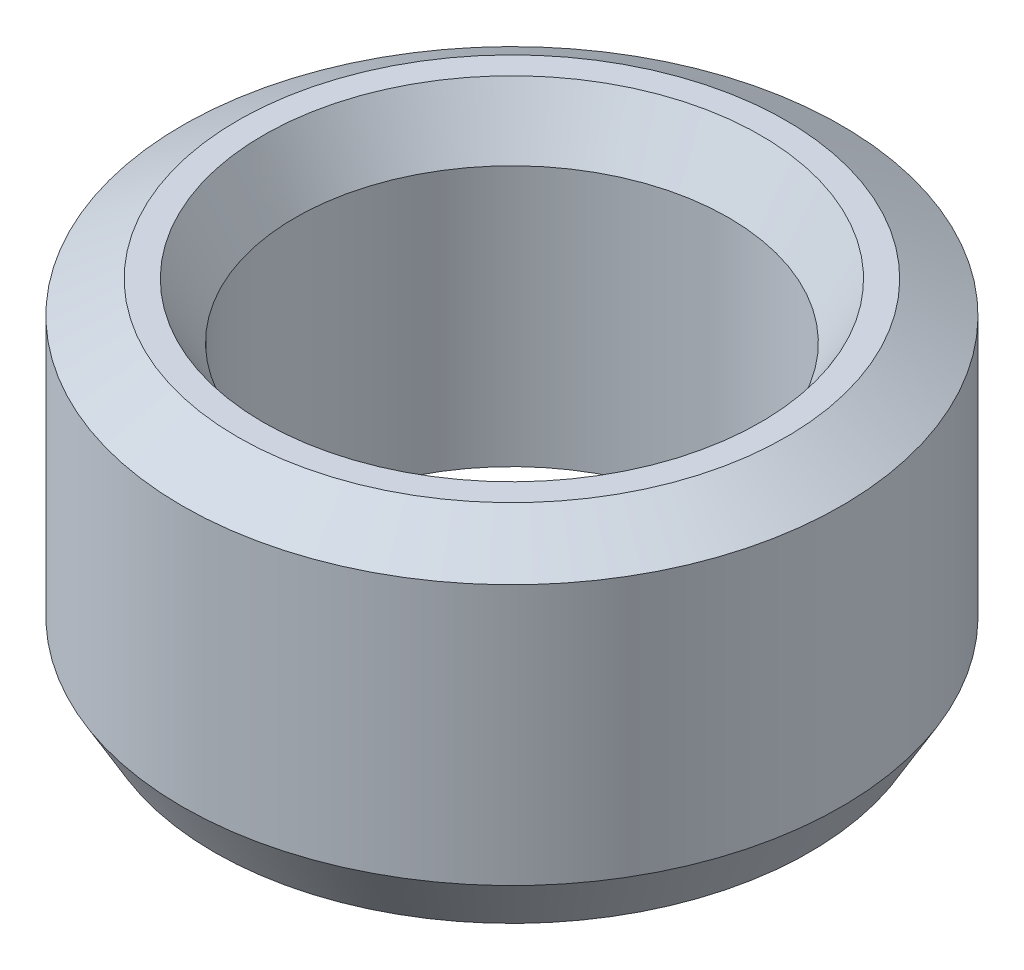
ISO-10303-21;
HEADER;
FILE_DESCRIPTION(('STEP AP214'),'2;1');
FILE_NAME('part.step','',(''),(''),'','','');
FILE_SCHEMA(('AUTOMOTIVE_DESIGN { 1 0 10303 214 1 1 1 1 }'));
ENDSEC;
DATA;
#1=APPLICATION_CONTEXT('core data for automotive mechanical design processes');
#2=APPLICATION_PROTOCOL_DEFINITION('international standard','automotive_design',2000,#1);
#3=PRODUCT_CONTEXT('',#1,'mechanical');
#4=PRODUCT('Part','Part','',(#3));
#5=PRODUCT_RELATED_PRODUCT_CATEGORY('part','',(#4));
#6=PRODUCT_DEFINITION_FORMATION('','',#4);
#7=PRODUCT_DEFINITION_CONTEXT('part definition',#1,'design');
#8=PRODUCT_DEFINITION('design','',#6,#7);
#9=PRODUCT_DEFINITION_SHAPE('','',#8);
#10=(LENGTH_UNIT() NAMED_UNIT(*) SI_UNIT(.MILLI.,.METRE.));
#11=(NAMED_UNIT(*) PLANE_ANGLE_UNIT() SI_UNIT($,.RADIAN.));
#12=(NAMED_UNIT(*) SI_UNIT($,.STERADIAN.) SOLID_ANGLE_UNIT());
#13=UNCERTAINTY_MEASURE_WITH_UNIT(LENGTH_MEASURE(1.E-05),#10,'distance_accuracy_value','');
#14=(GEOMETRIC_REPRESENTATION_CONTEXT(3) GLOBAL_UNCERTAINTY_ASSIGNED_CONTEXT((#13)) GLOBAL_UNIT_ASSIGNED_CONTEXT((#10,
#11,#12)) REPRESENTATION_CONTEXT('',''));
#15=CARTESIAN_POINT('',(0.,0.,0.));
#16=DIRECTION('',(0.,0.,1.));
#17=DIRECTION('',(1.,0.,0.));
#18=AXIS2_PLACEMENT_3D('',#15,#16,#17);
#19=CARTESIAN_POINT('',(0.,36.9426235670901,0.));
#20=DIRECTION('',(0.,-1.,0.));
#21=DIRECTION('',(0.,0.,-1.));
#22=AXIS2_PLACEMENT_3D('',#19,#20,#21);
#23=CYLINDRICAL_SURFACE('',#22,35.);
#24=CARTESIAN_POINT('',(0.,5.87959630314203,0.));
#25=DIRECTION('',(0.,1.,0.));
#26=DIRECTION('',(0.,0.,1.));
#27=AXIS2_PLACEMENT_3D('',#24,#25,#26);
#28=CIRCLE('',#27,35.);
#29=CARTESIAN_POINT('',(0.,5.87959630314203,35.));
#30=VERTEX_POINT('',#29);
#31=EDGE_CURVE('E10',#30,#30,#28,.T.);
#32=ORIENTED_EDGE('',*,*,#31,.T.);
#33=EDGE_LOOP('',(#32));
#34=FACE_BOUND('',#33,.T.);
#35=CARTESIAN_POINT('',(0.,33.5480370587447,0.));
#36=DIRECTION('',(0.,1.,0.));
#37=DIRECTION('',(0.,0.,1.));
#38=AXIS2_PLACEMENT_3D('',#35,#36,#37);
#39=CIRCLE('',#38,35.);
#40=CARTESIAN_POINT('',(0.,33.5480370587447,35.));
#41=VERTEX_POINT('',#40);
#42=EDGE_CURVE('E50',#41,#41,#39,.F.);
#43=ORIENTED_EDGE('',*,*,#42,.T.);
#44=EDGE_LOOP('',(#43));
#45=FACE_BOUND('',#44,.T.);
#46=ADVANCED_FACE('F39',(#34,#45),#23,.T.);
#47=CARTESIAN_POINT('',(0.,36.9426235670901,0.));
#48=DIRECTION('',(0.,1.,0.));
#49=DIRECTION('',(0.,0.,1.));
#50=AXIS2_PLACEMENT_3D('',#47,#48,#49);
#51=PLANE('',#50);
#52=CARTESIAN_POINT('',(0.,36.9426235670901,0.));
#53=DIRECTION('',(0.,1.,0.));
#54=DIRECTION('',(0.,0.,1.));
#55=AXIS2_PLACEMENT_3D('',#52,#53,#54);
#56=CIRCLE('',#55,26.4068512775485);
#57=CARTESIAN_POINT('',(0.,36.9426235670901,26.4068512775485));
#58=VERTEX_POINT('',#57);
#59=EDGE_CURVE('E58',#58,#58,#56,.F.);
#60=ORIENTED_EDGE('',*,*,#59,.T.);
#61=EDGE_LOOP('',(#60));
#62=FACE_BOUND('',#61,.T.);
#63=CARTESIAN_POINT('',(0.,36.9426235670901,0.));
#64=DIRECTION('',(0.,1.,0.));
#65=DIRECTION('',(0.,0.,1.));
#66=AXIS2_PLACEMENT_3D('',#63,#64,#65);
#67=CIRCLE('',#66,29.1204036968579);
#68=CARTESIAN_POINT('',(0.,36.9426235670901,29.1204036968579));
#69=VERTEX_POINT('',#68);
#70=EDGE_CURVE('E61',#69,#69,#67,.T.);
#71=ORIENTED_EDGE('',*,*,#70,.T.);
#72=EDGE_LOOP('',(#71));
#73=FACE_BOUND('',#72,.T.);
#74=ADVANCED_FACE('F88',(#62,#73),#51,.T.);
#75=CARTESIAN_POINT('',(0.,0.,0.));
#76=DIRECTION('',(0.,1.,0.));
#77=DIRECTION('',(0.,0.,1.));
#78=AXIS2_PLACEMENT_3D('',#75,#76,#77);
#79=PLANE('',#78);
#80=CARTESIAN_POINT('',(0.,0.,0.));
#81=DIRECTION('',(0.,1.,0.));
#82=DIRECTION('',(0.,0.,1.));
#83=AXIS2_PLACEMENT_3D('',#80,#81,#82);
#84=CIRCLE('',#83,28.8918610723451);
#85=CARTESIAN_POINT('',(0.,0.,28.8918610723451));
#86=VERTEX_POINT('',#85);
#87=EDGE_CURVE('E51',#86,#86,#84,.T.);
#88=ORIENTED_EDGE('',*,*,#87,.T.);
#89=EDGE_LOOP('',(#88));
#90=FACE_BOUND('',#89,.T.);
#91=CARTESIAN_POINT('',(0.,0.,0.));
#92=DIRECTION('',(0.,1.,0.));
#93=DIRECTION('',(0.,0.,1.));
#94=AXIS2_PLACEMENT_3D('',#91,#92,#93);
#95=CIRCLE('',#94,31.6054134916546);
#96=CARTESIAN_POINT('',(0.,0.,31.6054134916546));
#97=VERTEX_POINT('',#96);
#98=EDGE_CURVE('E54',#97,#97,#95,.F.);
#99=ORIENTED_EDGE('',*,*,#98,.T.);
#100=EDGE_LOOP('',(#99));
#101=FACE_BOUND('',#100,.T.);
#102=ADVANCED_FACE('F83',(#90,#101),#79,.F.);
#103=CARTESIAN_POINT('',(0.,36.9426235670901,0.));
#104=DIRECTION('',(0.,-1.,0.));
#105=DIRECTION('',(0.,0.,-1.));
#106=AXIS2_PLACEMENT_3D('',#103,#104,#105);
#107=CYLINDRICAL_SURFACE('',#106,23.012264769203);
#108=CARTESIAN_POINT('',(0.,31.0630272639481,0.));
#109=DIRECTION('',(0.,1.,0.));
#110=DIRECTION('',(0.,0.,1.));
#111=AXIS2_PLACEMENT_3D('',#108,#109,#110);
#112=CIRCLE('',#111,23.012264769203);
#113=CARTESIAN_POINT('',(0.,31.0630272639481,23.012264769203));
#114=VERTEX_POINT('',#113);
#115=EDGE_CURVE('E67',#114,#114,#112,.T.);
#116=ORIENTED_EDGE('',*,*,#115,.T.);
#117=EDGE_LOOP('',(#116));
#118=FACE_BOUND('',#117,.T.);
#119=CARTESIAN_POINT('',(0.,3.39458650834541,0.));
#120=DIRECTION('',(0.,1.,0.));
#121=DIRECTION('',(0.,0.,1.));
#122=AXIS2_PLACEMENT_3D('',#119,#120,#121);
#123=CIRCLE('',#122,23.012264769203);
#124=CARTESIAN_POINT('',(0.,3.39458650834541,23.012264769203));
#125=VERTEX_POINT('',#124);
#126=EDGE_CURVE('E69',#125,#125,#123,.F.);
#127=ORIENTED_EDGE('',*,*,#126,.T.);
#128=EDGE_LOOP('',(#127));
#129=FACE_BOUND('',#128,.T.);
#130=ADVANCED_FACE('F71',(#118,#129),#107,.F.);
#131=CARTESIAN_POINT('',(0.,31.0630272639481,0.));
#132=DIRECTION('',(0.,1.,0.));
#133=DIRECTION('',(0.,0.,1.));
#134=AXIS2_PLACEMENT_3D('',#131,#132,#133);
#135=CONICAL_SURFACE('',#134,23.012264769203,0.523598775598304);
#136=CARTESIAN_POINT('',(0.,36.9426235670901,26.4068512775485));
#137=CARTESIAN_POINT('',(0.,36.8813777722657,26.3714910014199));
#138=CARTESIAN_POINT('',(0.,36.8201319774413,26.3361307252913));
#139=CARTESIAN_POINT('',(0.,36.6976403877925,26.2654101730341));
#140=CARTESIAN_POINT('',(0.,36.6363945929681,26.2300498969055));
#141=CARTESIAN_POINT('',(0.,36.5139030033193,26.1593293446483));
#142=CARTESIAN_POINT('',(0.,36.4526572084949,26.1239690685197));
#143=CARTESIAN_POINT('',(0.,36.3301656188461,26.0532485162625));
#144=CARTESIAN_POINT('',(0.,36.2689198240218,26.0178882401339));
#145=CARTESIAN_POINT('',(0.,36.146428234373,25.9471676878767));
#146=CARTESIAN_POINT('',(0.,36.0851824395486,25.9118074117481));
#147=CARTESIAN_POINT('',(0.,35.9626908498998,25.8410868594909));
#148=CARTESIAN_POINT('',(0.,35.9014450550754,25.8057265833623));
#149=CARTESIAN_POINT('',(0.,35.7789534654266,25.7350060311051));
#150=CARTESIAN_POINT('',(0.,35.7177076706022,25.6996457549765));
#151=CARTESIAN_POINT('',(0.,35.5952160809534,25.6289252027193));
#152=CARTESIAN_POINT('',(0.,35.533970286129,25.5935649265907));
#153=CARTESIAN_POINT('',(0.,35.4114786964802,25.5228443743335));
#154=CARTESIAN_POINT('',(0.,35.3502329016558,25.4874840982049));
#155=CARTESIAN_POINT('',(0.,35.227741312007,25.4167635459477));
#156=CARTESIAN_POINT('',(0.,35.1664955171826,25.3814032698191));
#157=CARTESIAN_POINT('',(0.,35.0440039275338,25.3106827175619));
#158=CARTESIAN_POINT('',(0.,34.9827581327094,25.2753224414333));
#159=CARTESIAN_POINT('',(0.,34.8602665430606,25.2046018891761));
#160=CARTESIAN_POINT('',(0.,34.7990207482362,25.1692416130475));
#161=CARTESIAN_POINT('',(0.,34.6765291585874,25.0985210607903));
#162=CARTESIAN_POINT('',(0.,34.615283363763,25.0631607846617));
#163=CARTESIAN_POINT('',(0.,34.4927917741143,24.9924402324045));
#164=CARTESIAN_POINT('',(0.,34.4315459792899,24.9570799562759));
#165=CARTESIAN_POINT('',(0.,34.3090543896411,24.8863594040187));
#166=CARTESIAN_POINT('',(0.,34.2478085948167,24.8509991278901));
#167=CARTESIAN_POINT('',(0.,34.1253170051679,24.7802785756329));
#168=CARTESIAN_POINT('',(0.,34.0640712103435,24.7449182995043));
#169=CARTESIAN_POINT('',(0.,33.9415796206947,24.6741977472471));
#170=CARTESIAN_POINT('',(0.,33.8803338258703,24.6388374711185));
#171=CARTESIAN_POINT('',(0.,33.7578422362215,24.5681169188613));
#172=CARTESIAN_POINT('',(0.,33.6965964413971,24.5327566427328));
#173=CARTESIAN_POINT('',(0.,33.5741048517483,24.4620360904756));
#174=CARTESIAN_POINT('',(0.,33.5128590569239,24.426675814347));
#175=CARTESIAN_POINT('',(0.,33.3903674672751,24.3559552620898));
#176=CARTESIAN_POINT('',(0.,33.3291216724507,24.3205949859612));
#177=CARTESIAN_POINT('',(0.,33.2066300828019,24.249874433704));
#178=CARTESIAN_POINT('',(0.,33.1453842879775,24.2145141575754));
#179=CARTESIAN_POINT('',(0.,33.0228926983287,24.1437936053182));
#180=CARTESIAN_POINT('',(0.,32.9616469035044,24.1084333291896));
#181=CARTESIAN_POINT('',(0.,32.8391553138556,24.0377127769324));
#182=CARTESIAN_POINT('',(0.,32.7779095190312,24.0023525008038));
#183=CARTESIAN_POINT('',(0.,32.6554179293824,23.9316319485466));
#184=CARTESIAN_POINT('',(0.,32.594172134558,23.896271672418));
#185=CARTESIAN_POINT('',(0.,32.4716805449092,23.8255511201608));
#186=CARTESIAN_POINT('',(0.,32.4104347500848,23.7901908440322));
#187=CARTESIAN_POINT('',(0.,32.287943160436,23.719470291775));
#188=CARTESIAN_POINT('',(0.,32.2266973656116,23.6841100156464));
#189=CARTESIAN_POINT('',(0.,32.1042057759628,23.6133894633892));
#190=CARTESIAN_POINT('',(0.,32.0429599811384,23.5780291872606));
#191=CARTESIAN_POINT('',(0.,31.9204683914896,23.5073086350034));
#192=CARTESIAN_POINT('',(0.,31.8592225966652,23.4719483588748));
#193=CARTESIAN_POINT('',(0.,31.7367310070164,23.4012278066176));
#194=CARTESIAN_POINT('',(0.,31.675485212192,23.365867530489));
#195=CARTESIAN_POINT('',(0.,31.5529936225432,23.2951469782318));
#196=CARTESIAN_POINT('',(0.,31.4917478277188,23.2597867021032));
#197=CARTESIAN_POINT('',(0.,31.3692562380701,23.189066149846));
#198=CARTESIAN_POINT('',(0.,31.3080104432457,23.1537058737174));
#199=CARTESIAN_POINT('',(0.,31.1855188535969,23.0829853214602));
#200=CARTESIAN_POINT('',(0.,31.1242730587725,23.0476250453316));
#201=CARTESIAN_POINT('',(0.,31.0630272639481,23.012264769203));
#202=B_SPLINE_CURVE_WITH_KNOTS('',3,(#136,#137,#138,#139,#140,#141,#142,#143,#144,#145,#146,
#147,#148,#149,#150,#151,#152,#153,#154,#155,#156,#157,#158,#159,#160,#161,#162,#163,#164,#165,
#166,#167,#168,#169,#170,#171,#172,#173,#174,#175,#176,#177,#178,#179,#180,#181,#182,#183,#184,
#185,#186,#187,#188,#189,#190,#191,#192,#193,#194,#195,#196,#197,#198,#199,#200,#201),
.UNSPECIFIED.,.F.,.F.,(4,2,2,2,2,2,2,2,2,2,2,2,2,2,2,2,2,2,2,2,2,2,2,2,2,2,2,2,2,2,2,2,4),(0.,
0.212161656771591,0.424323313543176,0.636484970314767,0.848646627086352,1.06080828385794,
1.27296994062953,1.48513159740111,1.6972932541727,1.90945491094429,2.12161656771588,
2.33377822448746,2.54593988125905,2.75810153803064,2.97026319480222,3.18242485157381,
3.3945865083454,3.60674816511699,3.81890982188857,4.03107147866016,4.24323313543175,
4.45539479220334,4.66755644897492,4.8797181057465,5.0918797625181,5.30404141928968,
5.51620307606127,5.72836473283285,5.94052638960444,6.15268804637603,6.36484970314761,
6.5770113599192,6.78917301669079),.UNSPECIFIED.);
#203=EDGE_CURVE('BSEAM77',#58,#114,#202,.T.);
#204=ORIENTED_EDGE('',*,*,#59,.F.);
#205=ORIENTED_EDGE('',*,*,#115,.F.);
#206=ORIENTED_EDGE('',*,*,#203,.T.);
#207=ORIENTED_EDGE('',*,*,#203,.F.);
#208=EDGE_LOOP('',(#204,#206,#205,#207));
#209=FACE_BOUND('',#208,.T.);
#210=ADVANCED_FACE('F77',(#209),#135,.F.);
#211=CARTESIAN_POINT('',(0.,0.,0.));
#212=DIRECTION('',(0.,-1.,0.));
#213=DIRECTION('',(0.,0.,-1.));
#214=AXIS2_PLACEMENT_3D('',#211,#212,#213);
#215=CONICAL_SURFACE('',#214,28.8918610723451,1.04719755119659);
#216=ORIENTED_EDGE('',*,*,#126,.F.);
#217=EDGE_LOOP('',(#216));
#218=FACE_BOUND('',#217,.T.);
#219=ORIENTED_EDGE('',*,*,#87,.F.);
#220=EDGE_LOOP('',(#219));
#221=FACE_BOUND('',#220,.T.);
#222=ADVANCED_FACE('F73',(#218,#221),#215,.F.);
#223=CARTESIAN_POINT('',(0.,5.87959630314203,0.));
#224=DIRECTION('',(0.,1.,0.));
#225=DIRECTION('',(0.,0.,1.));
#226=AXIS2_PLACEMENT_3D('',#223,#224,#225);
#227=CONICAL_SURFACE('',#226,35.,0.523598775598302);
#228=ORIENTED_EDGE('',*,*,#98,.F.);
#229=EDGE_LOOP('',(#228));
#230=FACE_BOUND('',#229,.T.);
#231=ORIENTED_EDGE('',*,*,#31,.F.);
#232=EDGE_LOOP('',(#231));
#233=FACE_BOUND('',#232,.T.);
#234=ADVANCED_FACE('F76',(#230,#233),#227,.T.);
#235=CARTESIAN_POINT('',(0.,36.9426235670901,0.));
#236=DIRECTION('',(0.,-1.,0.));
#237=DIRECTION('',(0.,0.,-1.));
#238=AXIS2_PLACEMENT_3D('',#235,#236,#237);
#239=CONICAL_SURFACE('',#238,29.1204036968579,1.04719755119659);
#240=ORIENTED_EDGE('',*,*,#42,.F.);
#241=EDGE_LOOP('',(#240));
#242=FACE_BOUND('',#241,.T.);
#243=ORIENTED_EDGE('',*,*,#70,.F.);
#244=EDGE_LOOP('',(#243));
#245=FACE_BOUND('',#244,.T.);
#246=ADVANCED_FACE('F45',(#242,#245),#239,.T.);
#247=CLOSED_SHELL('',(#46,#74,#102,#130,#210,#222,#234,#246));
#248=MANIFOLD_SOLID_BREP('B2',#247);
#249=ADVANCED_BREP_SHAPE_REPRESENTATION('',(#18,#248),#14);
#250=SHAPE_DEFINITION_REPRESENTATION(#9,#249);
ENDSEC;
END-ISO-10303-21;
